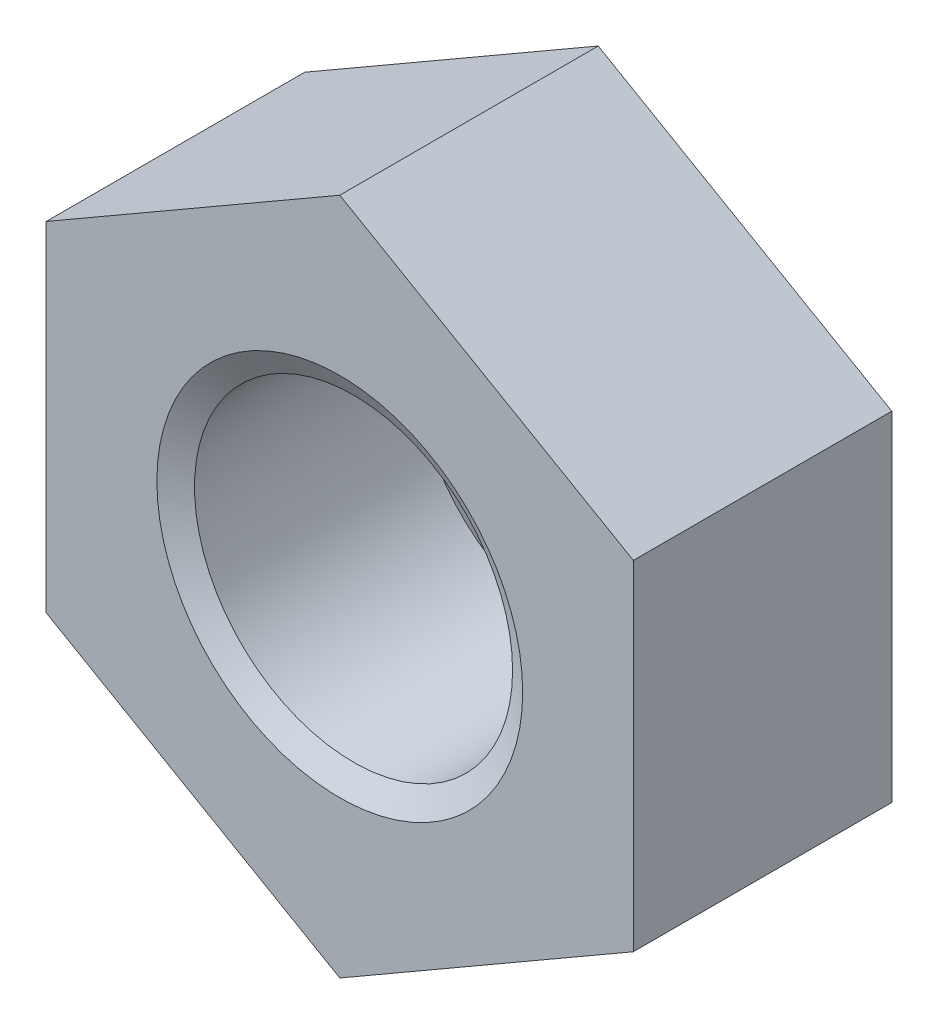
ISO-10303-21;
HEADER;
FILE_DESCRIPTION(('STEP AP214'),'2;1');
FILE_NAME('part.step','',(''),(''),'','','');
FILE_SCHEMA(('AUTOMOTIVE_DESIGN { 1 0 10303 214 1 1 1 1 }'));
ENDSEC;
DATA;
#1=APPLICATION_CONTEXT('core data for automotive mechanical design processes');
#2=APPLICATION_PROTOCOL_DEFINITION('international standard','automotive_design',2000,#1);
#3=PRODUCT_CONTEXT('',#1,'mechanical');
#4=PRODUCT('Part','Part','',(#3));
#5=PRODUCT_RELATED_PRODUCT_CATEGORY('part','',(#4));
#6=PRODUCT_DEFINITION_FORMATION('','',#4);
#7=PRODUCT_DEFINITION_CONTEXT('part definition',#1,'design');
#8=PRODUCT_DEFINITION('design','',#6,#7);
#9=PRODUCT_DEFINITION_SHAPE('','',#8);
#10=(LENGTH_UNIT() NAMED_UNIT(*) SI_UNIT(.MILLI.,.METRE.));
#11=(NAMED_UNIT(*) PLANE_ANGLE_UNIT() SI_UNIT($,.RADIAN.));
#12=(NAMED_UNIT(*) SI_UNIT($,.STERADIAN.) SOLID_ANGLE_UNIT());
#13=UNCERTAINTY_MEASURE_WITH_UNIT(LENGTH_MEASURE(1.E-05),#10,'distance_accuracy_value','');
#14=(GEOMETRIC_REPRESENTATION_CONTEXT(3) GLOBAL_UNCERTAINTY_ASSIGNED_CONTEXT((#13)) GLOBAL_UNIT_ASSIGNED_CONTEXT((#10,
#11,#12)) REPRESENTATION_CONTEXT('',''));
#15=CARTESIAN_POINT('',(0.,0.,0.));
#16=DIRECTION('',(0.,0.,1.));
#17=DIRECTION('',(1.,0.,0.));
#18=AXIS2_PLACEMENT_3D('',#15,#16,#17);
#19=CARTESIAN_POINT('',(0.,0.,1.3));
#20=DIRECTION('',(0.,0.,1.));
#21=DIRECTION('',(1.,0.,0.));
#22=AXIS2_PLACEMENT_3D('',#19,#20,#21);
#23=PLANE('',#22);
#24=CARTESIAN_POINT('',(0.,0.,1.3));
#25=DIRECTION('',(0.,0.,1.));
#26=DIRECTION('',(1.,0.,0.));
#27=AXIS2_PLACEMENT_3D('',#24,#25,#26);
#28=CIRCLE('',#27,0.920000000000001);
#29=CARTESIAN_POINT('',(0.920000000000001,0.,1.3));
#30=VERTEX_POINT('',#29);
#31=EDGE_CURVE('E11',#30,#30,#28,.F.);
#32=ORIENTED_EDGE('',*,*,#31,.T.);
#33=EDGE_LOOP('',(#32));
#34=FACE_BOUND('',#33,.T.);
#35=DIRECTION('',(-0.866025403784441,0.499999999999995,0.));
#36=VECTOR('',#35,1.);
#37=CARTESIAN_POINT('',(1.47657331345246,0.852500000000017,1.3));
#38=LINE('',#37,#36);
#39=CARTESIAN_POINT('',(1.47657331345246,0.852500000000017,1.3));
#40=VERTEX_POINT('',#39);
#41=CARTESIAN_POINT('',(0.,1.705,1.3));
#42=VERTEX_POINT('',#41);
#43=EDGE_CURVE('E134',#40,#42,#38,.T.);
#44=ORIENTED_EDGE('',*,*,#43,.T.);
#45=DIRECTION('',(-0.866025403784438,-0.500000000000001,0.));
#46=VECTOR('',#45,1.);
#47=CARTESIAN_POINT('',(0.,1.705,1.3));
#48=LINE('',#47,#46);
#49=CARTESIAN_POINT('',(-1.47657331345247,0.852499999999996,1.3));
#50=VERTEX_POINT('',#49);
#51=EDGE_CURVE('E94',#42,#50,#48,.T.);
#52=ORIENTED_EDGE('',*,*,#51,.T.);
#53=DIRECTION('',(0.,-1.,0.));
#54=VECTOR('',#53,1.);
#55=CARTESIAN_POINT('',(-1.47657331345247,0.852499999999996,1.3));
#56=LINE('',#55,#54);
#57=CARTESIAN_POINT('',(-1.47657331345246,-0.852500000000007,1.3));
#58=VERTEX_POINT('',#57);
#59=EDGE_CURVE('E106',#50,#58,#56,.T.);
#60=ORIENTED_EDGE('',*,*,#59,.T.);
#61=DIRECTION('',(0.866025403784441,-0.499999999999995,0.));
#62=VECTOR('',#61,1.);
#63=CARTESIAN_POINT('',(-1.47657331345246,-0.852500000000007,1.3));
#64=LINE('',#63,#62);
#65=CARTESIAN_POINT('',(0.,-1.705,1.3));
#66=VERTEX_POINT('',#65);
#67=EDGE_CURVE('E101',#58,#66,#64,.T.);
#68=ORIENTED_EDGE('',*,*,#67,.T.);
#69=DIRECTION('',(0.866025403784434,0.500000000000007,0.));
#70=VECTOR('',#69,1.);
#71=CARTESIAN_POINT('',(0.,-1.705,1.3));
#72=LINE('',#71,#70);
#73=CARTESIAN_POINT('',(1.47657331345248,-0.852499999999986,1.3));
#74=VERTEX_POINT('',#73);
#75=EDGE_CURVE('E104',#66,#74,#72,.T.);
#76=ORIENTED_EDGE('',*,*,#75,.T.);
#77=DIRECTION('',(0.,1.,0.));
#78=VECTOR('',#77,1.);
#79=CARTESIAN_POINT('',(1.47657331345248,-0.852499999999986,1.3));
#80=LINE('',#79,#78);
#81=EDGE_CURVE('E56',#74,#40,#80,.T.);
#82=ORIENTED_EDGE('',*,*,#81,.T.);
#83=EDGE_LOOP('',(#44,#52,#60,#68,#76,#82));
#84=FACE_BOUND('',#83,.T.);
#85=ADVANCED_FACE('F39',(#34,#84),#23,.T.);
#86=CARTESIAN_POINT('',(0.,0.,0.));
#87=DIRECTION('',(0.,0.,1.));
#88=DIRECTION('',(1.,0.,0.));
#89=AXIS2_PLACEMENT_3D('',#86,#87,#88);
#90=PLANE('',#89);
#91=CARTESIAN_POINT('',(0.,0.,0.));
#92=DIRECTION('',(0.,0.,1.));
#93=DIRECTION('',(1.,0.,0.));
#94=AXIS2_PLACEMENT_3D('',#91,#92,#93);
#95=CIRCLE('',#94,0.869282032302756);
#96=CARTESIAN_POINT('',(0.869282032302756,0.,0.));
#97=VERTEX_POINT('',#96);
#98=EDGE_CURVE('E143',#97,#97,#95,.T.);
#99=ORIENTED_EDGE('',*,*,#98,.T.);
#100=EDGE_LOOP('',(#99));
#101=FACE_BOUND('',#100,.T.);
#102=DIRECTION('',(-0.866025403784441,0.499999999999995,0.));
#103=VECTOR('',#102,1.);
#104=CARTESIAN_POINT('',(1.47657331345246,0.852500000000017,0.));
#105=LINE('',#104,#103);
#106=CARTESIAN_POINT('',(1.47657331345246,0.852500000000017,0.));
#107=VERTEX_POINT('',#106);
#108=CARTESIAN_POINT('',(0.,1.705,0.));
#109=VERTEX_POINT('',#108);
#110=EDGE_CURVE('E124',#107,#109,#105,.T.);
#111=ORIENTED_EDGE('',*,*,#110,.F.);
#112=DIRECTION('',(0.,1.,0.));
#113=VECTOR('',#112,1.);
#114=CARTESIAN_POINT('',(1.47657331345248,-0.852499999999986,0.));
#115=LINE('',#114,#113);
#116=CARTESIAN_POINT('',(1.47657331345248,-0.852499999999986,0.));
#117=VERTEX_POINT('',#116);
#118=EDGE_CURVE('E85',#117,#107,#115,.T.);
#119=ORIENTED_EDGE('',*,*,#118,.F.);
#120=DIRECTION('',(0.866025403784434,0.500000000000007,0.));
#121=VECTOR('',#120,1.);
#122=CARTESIAN_POINT('',(0.,-1.705,0.));
#123=LINE('',#122,#121);
#124=CARTESIAN_POINT('',(0.,-1.705,0.));
#125=VERTEX_POINT('',#124);
#126=EDGE_CURVE('E79',#125,#117,#123,.T.);
#127=ORIENTED_EDGE('',*,*,#126,.F.);
#128=DIRECTION('',(0.866025403784441,-0.499999999999995,0.));
#129=VECTOR('',#128,1.);
#130=CARTESIAN_POINT('',(-1.47657331345246,-0.852500000000007,0.));
#131=LINE('',#130,#129);
#132=CARTESIAN_POINT('',(-1.47657331345246,-0.852500000000007,0.));
#133=VERTEX_POINT('',#132);
#134=EDGE_CURVE('E114',#133,#125,#131,.T.);
#135=ORIENTED_EDGE('',*,*,#134,.F.);
#136=DIRECTION('',(0.,-1.,0.));
#137=VECTOR('',#136,1.);
#138=CARTESIAN_POINT('',(-1.47657331345247,0.852499999999996,0.));
#139=LINE('',#138,#137);
#140=CARTESIAN_POINT('',(-1.47657331345247,0.852499999999996,0.));
#141=VERTEX_POINT('',#140);
#142=EDGE_CURVE('E129',#141,#133,#139,.T.);
#143=ORIENTED_EDGE('',*,*,#142,.F.);
#144=DIRECTION('',(-0.866025403784438,-0.500000000000001,0.));
#145=VECTOR('',#144,1.);
#146=CARTESIAN_POINT('',(0.,1.705,0.));
#147=LINE('',#146,#145);
#148=EDGE_CURVE('E127',#109,#141,#147,.T.);
#149=ORIENTED_EDGE('',*,*,#148,.F.);
#150=EDGE_LOOP('',(#111,#119,#127,#135,#143,#149));
#151=FACE_BOUND('',#150,.T.);
#152=ADVANCED_FACE('F159',(#101,#151),#90,.F.);
#153=CARTESIAN_POINT('',(1.47657331345246,0.852500000000017,1.3));
#154=DIRECTION('',(-0.499999999999995,-0.866025403784442,0.));
#155=DIRECTION('',(0.866025403784442,-0.499999999999995,0.));
#156=AXIS2_PLACEMENT_3D('',#153,#154,#155);
#157=PLANE('',#156);
#158=ORIENTED_EDGE('',*,*,#110,.T.);
#159=DIRECTION('',(0.,0.,-1.));
#160=VECTOR('',#159,1.);
#161=CARTESIAN_POINT('',(0.,1.705,1.3));
#162=LINE('',#161,#160);
#163=EDGE_CURVE('E141',#42,#109,#162,.T.);
#164=ORIENTED_EDGE('',*,*,#163,.F.);
#165=ORIENTED_EDGE('',*,*,#43,.F.);
#166=DIRECTION('',(0.,0.,-1.));
#167=VECTOR('',#166,1.);
#168=CARTESIAN_POINT('',(1.47657331345246,0.852500000000017,1.3));
#169=LINE('',#168,#167);
#170=EDGE_CURVE('E120',#40,#107,#169,.T.);
#171=ORIENTED_EDGE('',*,*,#170,.T.);
#172=EDGE_LOOP('',(#158,#164,#165,#171));
#173=FACE_BOUND('',#172,.T.);
#174=ADVANCED_FACE('F162',(#173),#157,.F.);
#175=CARTESIAN_POINT('',(0.,1.705,1.3));
#176=DIRECTION('',(0.500000000000001,-0.866025403784438,0.));
#177=DIRECTION('',(0.866025403784438,0.500000000000001,0.));
#178=AXIS2_PLACEMENT_3D('',#175,#176,#177);
#179=PLANE('',#178);
#180=ORIENTED_EDGE('',*,*,#148,.T.);
#181=DIRECTION('',(0.,0.,-1.));
#182=VECTOR('',#181,1.);
#183=CARTESIAN_POINT('',(-1.47657331345247,0.852499999999996,1.3));
#184=LINE('',#183,#182);
#185=EDGE_CURVE('E138',#50,#141,#184,.T.);
#186=ORIENTED_EDGE('',*,*,#185,.F.);
#187=ORIENTED_EDGE('',*,*,#51,.F.);
#188=ORIENTED_EDGE('',*,*,#163,.T.);
#189=EDGE_LOOP('',(#180,#186,#187,#188));
#190=FACE_BOUND('',#189,.T.);
#191=ADVANCED_FACE('F238',(#190),#179,.F.);
#192=CARTESIAN_POINT('',(-1.47657331345247,0.852499999999996,1.3));
#193=DIRECTION('',(1.,0.,0.));
#194=DIRECTION('',(0.,1.,0.));
#195=AXIS2_PLACEMENT_3D('',#192,#193,#194);
#196=PLANE('',#195);
#197=ORIENTED_EDGE('',*,*,#142,.T.);
#198=DIRECTION('',(0.,0.,-1.));
#199=VECTOR('',#198,1.);
#200=CARTESIAN_POINT('',(-1.47657331345246,-0.852500000000007,1.3));
#201=LINE('',#200,#199);
#202=EDGE_CURVE('E115',#58,#133,#201,.T.);
#203=ORIENTED_EDGE('',*,*,#202,.F.);
#204=ORIENTED_EDGE('',*,*,#59,.F.);
#205=ORIENTED_EDGE('',*,*,#185,.T.);
#206=EDGE_LOOP('',(#197,#203,#204,#205));
#207=FACE_BOUND('',#206,.T.);
#208=ADVANCED_FACE('F229',(#207),#196,.F.);
#209=CARTESIAN_POINT('',(-1.47657331345246,-0.852500000000007,1.3));
#210=DIRECTION('',(0.499999999999995,0.866025403784442,0.));
#211=DIRECTION('',(-0.866025403784442,0.499999999999995,0.));
#212=AXIS2_PLACEMENT_3D('',#209,#210,#211);
#213=PLANE('',#212);
#214=ORIENTED_EDGE('',*,*,#134,.T.);
#215=DIRECTION('',(0.,0.,-1.));
#216=VECTOR('',#215,1.);
#217=CARTESIAN_POINT('',(0.,-1.705,1.3));
#218=LINE('',#217,#216);
#219=EDGE_CURVE('E111',#66,#125,#218,.T.);
#220=ORIENTED_EDGE('',*,*,#219,.F.);
#221=ORIENTED_EDGE('',*,*,#67,.F.);
#222=ORIENTED_EDGE('',*,*,#202,.T.);
#223=EDGE_LOOP('',(#214,#220,#221,#222));
#224=FACE_BOUND('',#223,.T.);
#225=ADVANCED_FACE('F112',(#224),#213,.F.);
#226=CARTESIAN_POINT('',(0.,-1.705,1.3));
#227=DIRECTION('',(-0.500000000000007,0.866025403784435,0.));
#228=DIRECTION('',(-0.866025403784435,-0.500000000000007,0.));
#229=AXIS2_PLACEMENT_3D('',#226,#227,#228);
#230=PLANE('',#229);
#231=ORIENTED_EDGE('',*,*,#126,.T.);
#232=DIRECTION('',(0.,0.,-1.));
#233=VECTOR('',#232,1.);
#234=CARTESIAN_POINT('',(1.47657331345248,-0.852499999999986,1.3));
#235=LINE('',#234,#233);
#236=EDGE_CURVE('E116',#74,#117,#235,.T.);
#237=ORIENTED_EDGE('',*,*,#236,.F.);
#238=ORIENTED_EDGE('',*,*,#75,.F.);
#239=ORIENTED_EDGE('',*,*,#219,.T.);
#240=EDGE_LOOP('',(#231,#237,#238,#239));
#241=FACE_BOUND('',#240,.T.);
#242=ADVANCED_FACE('F118',(#241),#230,.F.);
#243=CARTESIAN_POINT('',(1.47657331345248,-0.852499999999986,1.3));
#244=DIRECTION('',(-1.,0.,0.));
#245=DIRECTION('',(0.,-1.,0.));
#246=AXIS2_PLACEMENT_3D('',#243,#244,#245);
#247=PLANE('',#246);
#248=ORIENTED_EDGE('',*,*,#118,.T.);
#249=ORIENTED_EDGE('',*,*,#170,.F.);
#250=ORIENTED_EDGE('',*,*,#81,.F.);
#251=ORIENTED_EDGE('',*,*,#236,.T.);
#252=EDGE_LOOP('',(#248,#249,#250,#251));
#253=FACE_BOUND('',#252,.T.);
#254=ADVANCED_FACE('F169',(#253),#247,.F.);
#255=CARTESIAN_POINT('',(0.,0.,1.3));
#256=DIRECTION('',(0.,0.,-1.));
#257=DIRECTION('',(-1.,0.,0.));
#258=AXIS2_PLACEMENT_3D('',#255,#256,#257);
#259=CYLINDRICAL_SURFACE('',#258,0.8);
#260=CARTESIAN_POINT('',(0.,0.,0.120000000000001));
#261=DIRECTION('',(0.,0.,1.));
#262=DIRECTION('',(1.,0.,0.));
#263=AXIS2_PLACEMENT_3D('',#260,#261,#262);
#264=CIRCLE('',#263,0.8);
#265=CARTESIAN_POINT('',(0.8,0.,0.120000000000001));
#266=VERTEX_POINT('',#265);
#267=EDGE_CURVE('E48',#266,#266,#264,.F.);
#268=ORIENTED_EDGE('',*,*,#267,.T.);
#269=EDGE_LOOP('',(#268));
#270=FACE_BOUND('',#269,.T.);
#271=CARTESIAN_POINT('',(0.,0.,1.23071796769724));
#272=DIRECTION('',(0.,0.,1.));
#273=DIRECTION('',(1.,0.,0.));
#274=AXIS2_PLACEMENT_3D('',#271,#272,#273);
#275=CIRCLE('',#274,0.8);
#276=CARTESIAN_POINT('',(0.8,0.,1.23071796769724));
#277=VERTEX_POINT('',#276);
#278=EDGE_CURVE('E146',#277,#277,#275,.T.);
#279=ORIENTED_EDGE('',*,*,#278,.T.);
#280=EDGE_LOOP('',(#279));
#281=FACE_BOUND('',#280,.T.);
#282=ADVANCED_FACE('F151',(#270,#281),#259,.F.);
#283=CARTESIAN_POINT('',(0.,0.,0.));
#284=DIRECTION('',(0.,0.,-1.));
#285=DIRECTION('',(-1.,0.,0.));
#286=AXIS2_PLACEMENT_3D('',#283,#284,#285);
#287=CONICAL_SURFACE('',#286,0.869282032302756,0.523598775598299);
#288=ORIENTED_EDGE('',*,*,#267,.F.);
#289=EDGE_LOOP('',(#288));
#290=FACE_BOUND('',#289,.T.);
#291=ORIENTED_EDGE('',*,*,#98,.F.);
#292=EDGE_LOOP('',(#291));
#293=FACE_BOUND('',#292,.T.);
#294=ADVANCED_FACE('F154',(#290,#293),#287,.F.);
#295=CARTESIAN_POINT('',(0.,0.,1.23071796769724));
#296=DIRECTION('',(0.,0.,1.));
#297=DIRECTION('',(1.,0.,0.));
#298=AXIS2_PLACEMENT_3D('',#295,#296,#297);
#299=CONICAL_SURFACE('',#298,0.8,1.0471975511966);
#300=ORIENTED_EDGE('',*,*,#31,.F.);
#301=EDGE_LOOP('',(#300));
#302=FACE_BOUND('',#301,.T.);
#303=ORIENTED_EDGE('',*,*,#278,.F.);
#304=EDGE_LOOP('',(#303));
#305=FACE_BOUND('',#304,.T.);
#306=ADVANCED_FACE('F41',(#302,#305),#299,.F.);
#307=CLOSED_SHELL('',(#85,#152,#174,#191,#208,#225,#242,#254,#282,#294,#306));
#308=MANIFOLD_SOLID_BREP('B2',#307);
#309=ADVANCED_BREP_SHAPE_REPRESENTATION('',(#18,#308),#14);
#310=SHAPE_DEFINITION_REPRESENTATION(#9,#309);
ENDSEC;
END-ISO-10303-21;
